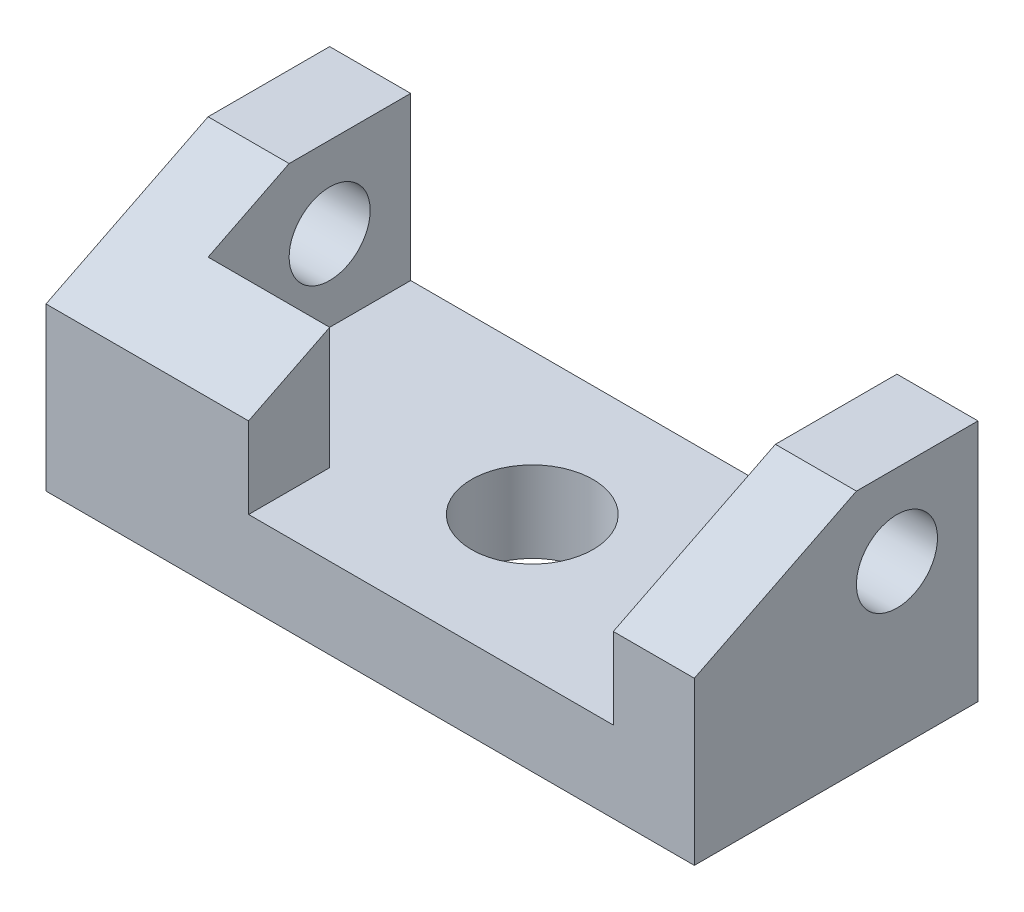
ISO-10303-21;
HEADER;
FILE_DESCRIPTION(('STEP AP214'),'2;1');
FILE_NAME('part.step','',(''),(''),'','','');
FILE_SCHEMA(('AUTOMOTIVE_DESIGN { 1 0 10303 214 1 1 1 1 }'));
ENDSEC;
DATA;
#1=APPLICATION_CONTEXT('core data for automotive mechanical design processes');
#2=APPLICATION_PROTOCOL_DEFINITION('international standard','automotive_design',2000,#1);
#3=PRODUCT_CONTEXT('',#1,'mechanical');
#4=PRODUCT('Part','Part','',(#3));
#5=PRODUCT_RELATED_PRODUCT_CATEGORY('part','',(#4));
#6=PRODUCT_DEFINITION_FORMATION('','',#4);
#7=PRODUCT_DEFINITION_CONTEXT('part definition',#1,'design');
#8=PRODUCT_DEFINITION('design','',#6,#7);
#9=PRODUCT_DEFINITION_SHAPE('','',#8);
#10=(LENGTH_UNIT() NAMED_UNIT(*) SI_UNIT(.MILLI.,.METRE.));
#11=(NAMED_UNIT(*) PLANE_ANGLE_UNIT() SI_UNIT($,.RADIAN.));
#12=(NAMED_UNIT(*) SI_UNIT($,.STERADIAN.) SOLID_ANGLE_UNIT());
#13=UNCERTAINTY_MEASURE_WITH_UNIT(LENGTH_MEASURE(1.E-05),#10,'distance_accuracy_value','');
#14=(GEOMETRIC_REPRESENTATION_CONTEXT(3) GLOBAL_UNCERTAINTY_ASSIGNED_CONTEXT((#13)) GLOBAL_UNIT_ASSIGNED_CONTEXT((#10,
#11,#12)) REPRESENTATION_CONTEXT('',''));
#15=CARTESIAN_POINT('',(0.,0.,0.));
#16=DIRECTION('',(0.,0.,1.));
#17=DIRECTION('',(1.,0.,0.));
#18=AXIS2_PLACEMENT_3D('',#15,#16,#17);
#19=CARTESIAN_POINT('',(0.,30.,0.));
#20=DIRECTION('',(0.,-1.,0.));
#21=DIRECTION('',(0.,0.,-1.));
#22=AXIS2_PLACEMENT_3D('',#19,#20,#21);
#23=PLANE('',#22);
#24=DIRECTION('',(0.,0.,-1.));
#25=VECTOR('',#24,1.);
#26=CARTESIAN_POINT('',(70.,30.,0.));
#27=LINE('',#26,#25);
#28=CARTESIAN_POINT('',(70.,30.,-20.));
#29=VERTEX_POINT('',#28);
#30=CARTESIAN_POINT('',(70.,30.,-35.));
#31=VERTEX_POINT('',#30);
#32=EDGE_CURVE('E143',#29,#31,#27,.T.);
#33=ORIENTED_EDGE('',*,*,#32,.F.);
#34=DIRECTION('',(-1.,0.,0.));
#35=VECTOR('',#34,1.);
#36=CARTESIAN_POINT('',(80.,30.,-20.));
#37=LINE('',#36,#35);
#38=CARTESIAN_POINT('',(80.,30.,-20.));
#39=VERTEX_POINT('',#38);
#40=EDGE_CURVE('E56',#39,#29,#37,.T.);
#41=ORIENTED_EDGE('',*,*,#40,.F.);
#42=DIRECTION('',(0.,0.,-1.));
#43=VECTOR('',#42,1.);
#44=CARTESIAN_POINT('',(80.,30.,0.));
#45=LINE('',#44,#43);
#46=CARTESIAN_POINT('',(80.,30.,-35.));
#47=VERTEX_POINT('',#46);
#48=EDGE_CURVE('E141',#39,#47,#45,.T.);
#49=ORIENTED_EDGE('',*,*,#48,.T.);
#50=DIRECTION('',(-1.,0.,0.));
#51=VECTOR('',#50,1.);
#52=CARTESIAN_POINT('',(0.,30.,-35.));
#53=LINE('',#52,#51);
#54=EDGE_CURVE('E157',#47,#31,#53,.T.);
#55=ORIENTED_EDGE('',*,*,#54,.T.);
#56=EDGE_LOOP('',(#33,#41,#49,#55));
#57=FACE_BOUND('',#56,.T.);
#58=ADVANCED_FACE('F39',(#57),#23,.F.);
#59=CARTESIAN_POINT('',(0.,30.,0.));
#60=DIRECTION('',(1.,0.,0.));
#61=DIRECTION('',(0.,0.,-1.));
#62=AXIS2_PLACEMENT_3D('',#59,#60,#61);
#63=PLANE('',#62);
#64=CARTESIAN_POINT('',(0.,20.,-25.));
#65=DIRECTION('',(1.,0.,0.));
#66=DIRECTION('',(0.,0.,-1.));
#67=AXIS2_PLACEMENT_3D('',#64,#65,#66);
#68=CIRCLE('',#67,5.);
#69=CARTESIAN_POINT('',(0.,20.,-30.));
#70=VERTEX_POINT('',#69);
#71=EDGE_CURVE('E324',#70,#70,#68,.T.);
#72=ORIENTED_EDGE('',*,*,#71,.T.);
#73=EDGE_LOOP('',(#72));
#74=FACE_BOUND('',#73,.T.);
#75=DIRECTION('',(0.,-1.,0.));
#76=VECTOR('',#75,1.);
#77=CARTESIAN_POINT('',(0.,30.,0.));
#78=LINE('',#77,#76);
#79=CARTESIAN_POINT('',(0.,20.,0.));
#80=VERTEX_POINT('',#79);
#81=CARTESIAN_POINT('',(0.,0.,0.));
#82=VERTEX_POINT('',#81);
#83=EDGE_CURVE('E49',#80,#82,#78,.T.);
#84=ORIENTED_EDGE('',*,*,#83,.F.);
#85=DIRECTION('',(0.,-0.447213595499958,0.894427190999916));
#86=VECTOR('',#85,1.);
#87=CARTESIAN_POINT('',(0.,20.,0.));
#88=LINE('',#87,#86);
#89=CARTESIAN_POINT('',(0.,30.,-20.));
#90=VERTEX_POINT('',#89);
#91=EDGE_CURVE('E136',#90,#80,#88,.T.);
#92=ORIENTED_EDGE('',*,*,#91,.F.);
#93=DIRECTION('',(0.,0.,1.));
#94=VECTOR('',#93,1.);
#95=CARTESIAN_POINT('',(0.,30.,0.));
#96=LINE('',#95,#94);
#97=CARTESIAN_POINT('',(0.,30.,-35.));
#98=VERTEX_POINT('',#97);
#99=EDGE_CURVE('E153',#98,#90,#96,.T.);
#100=ORIENTED_EDGE('',*,*,#99,.F.);
#101=DIRECTION('',(0.,-1.,0.));
#102=VECTOR('',#101,1.);
#103=CARTESIAN_POINT('',(0.,30.,-35.));
#104=LINE('',#103,#102);
#105=CARTESIAN_POINT('',(0.,0.,-35.));
#106=VERTEX_POINT('',#105);
#107=EDGE_CURVE('E165',#98,#106,#104,.T.);
#108=ORIENTED_EDGE('',*,*,#107,.T.);
#109=DIRECTION('',(0.,0.,1.));
#110=VECTOR('',#109,1.);
#111=CARTESIAN_POINT('',(0.,0.,0.));
#112=LINE('',#111,#110);
#113=EDGE_CURVE('E166',#106,#82,#112,.T.);
#114=ORIENTED_EDGE('',*,*,#113,.T.);
#115=EDGE_LOOP('',(#84,#92,#100,#108,#114));
#116=FACE_BOUND('',#115,.T.);
#117=ADVANCED_FACE('F41',(#74,#116),#63,.F.);
#118=CARTESIAN_POINT('',(0.,30.,0.));
#119=DIRECTION('',(0.,0.,-1.));
#120=DIRECTION('',(-1.,0.,0.));
#121=AXIS2_PLACEMENT_3D('',#118,#119,#120);
#122=PLANE('',#121);
#123=DIRECTION('',(0.,-1.,0.));
#124=VECTOR('',#123,1.);
#125=CARTESIAN_POINT('',(80.,30.,0.));
#126=LINE('',#125,#124);
#127=CARTESIAN_POINT('',(80.,20.,0.));
#128=VERTEX_POINT('',#127);
#129=CARTESIAN_POINT('',(80.,0.,0.));
#130=VERTEX_POINT('',#129);
#131=EDGE_CURVE('E185',#128,#130,#126,.T.);
#132=ORIENTED_EDGE('',*,*,#131,.F.);
#133=DIRECTION('',(-1.,0.,0.));
#134=VECTOR('',#133,1.);
#135=CARTESIAN_POINT('',(80.,20.,0.));
#136=LINE('',#135,#134);
#137=CARTESIAN_POINT('',(70.,20.,0.));
#138=VERTEX_POINT('',#137);
#139=EDGE_CURVE('E130',#128,#138,#136,.T.);
#140=ORIENTED_EDGE('',*,*,#139,.T.);
#141=DIRECTION('',(0.,1.,0.));
#142=VECTOR('',#141,1.);
#143=CARTESIAN_POINT('',(70.,10.,0.));
#144=LINE('',#143,#142);
#145=CARTESIAN_POINT('',(70.,10.,0.));
#146=VERTEX_POINT('',#145);
#147=EDGE_CURVE('E216',#146,#138,#144,.T.);
#148=ORIENTED_EDGE('',*,*,#147,.F.);
#149=DIRECTION('',(1.,0.,0.));
#150=VECTOR('',#149,1.);
#151=CARTESIAN_POINT('',(25.,10.,0.));
#152=LINE('',#151,#150);
#153=CARTESIAN_POINT('',(25.,10.,0.));
#154=VERTEX_POINT('',#153);
#155=EDGE_CURVE('E241',#154,#146,#152,.T.);
#156=ORIENTED_EDGE('',*,*,#155,.F.);
#157=DIRECTION('',(0.,1.,0.));
#158=VECTOR('',#157,1.);
#159=CARTESIAN_POINT('',(25.,10.,0.));
#160=LINE('',#159,#158);
#161=CARTESIAN_POINT('',(25.,20.,0.));
#162=VERTEX_POINT('',#161);
#163=EDGE_CURVE('E220',#154,#162,#160,.T.);
#164=ORIENTED_EDGE('',*,*,#163,.T.);
#165=EDGE_CURVE('E145',#162,#80,#136,.T.);
#166=ORIENTED_EDGE('',*,*,#165,.T.);
#167=ORIENTED_EDGE('',*,*,#83,.T.);
#168=DIRECTION('',(1.,0.,0.));
#169=VECTOR('',#168,1.);
#170=CARTESIAN_POINT('',(0.,0.,0.));
#171=LINE('',#170,#169);
#172=EDGE_CURVE('E170',#82,#130,#171,.T.);
#173=ORIENTED_EDGE('',*,*,#172,.T.);
#174=EDGE_LOOP('',(#132,#140,#148,#156,#164,#166,#167,#173));
#175=FACE_BOUND('',#174,.T.);
#176=ADVANCED_FACE('F193',(#175),#122,.F.);
#177=CARTESIAN_POINT('',(80.,30.,0.));
#178=DIRECTION('',(-1.,0.,0.));
#179=DIRECTION('',(0.,0.,1.));
#180=AXIS2_PLACEMENT_3D('',#177,#178,#179);
#181=PLANE('',#180);
#182=CARTESIAN_POINT('',(80.,20.,-25.));
#183=DIRECTION('',(1.,0.,0.));
#184=DIRECTION('',(0.,0.,-1.));
#185=AXIS2_PLACEMENT_3D('',#182,#183,#184);
#186=CIRCLE('',#185,5.);
#187=CARTESIAN_POINT('',(80.,20.,-30.));
#188=VERTEX_POINT('',#187);
#189=EDGE_CURVE('E320',#188,#188,#186,.T.);
#190=ORIENTED_EDGE('',*,*,#189,.F.);
#191=EDGE_LOOP('',(#190));
#192=FACE_BOUND('',#191,.T.);
#193=ORIENTED_EDGE('',*,*,#48,.F.);
#194=DIRECTION('',(0.,-0.447213595499958,0.894427190999916));
#195=VECTOR('',#194,1.);
#196=CARTESIAN_POINT('',(80.,20.,0.));
#197=LINE('',#196,#195);
#198=EDGE_CURVE('E127',#39,#128,#197,.T.);
#199=ORIENTED_EDGE('',*,*,#198,.T.);
#200=ORIENTED_EDGE('',*,*,#131,.T.);
#201=DIRECTION('',(0.,0.,-1.));
#202=VECTOR('',#201,1.);
#203=CARTESIAN_POINT('',(80.,0.,0.));
#204=LINE('',#203,#202);
#205=CARTESIAN_POINT('',(80.,0.,-35.));
#206=VERTEX_POINT('',#205);
#207=EDGE_CURVE('E175',#130,#206,#204,.T.);
#208=ORIENTED_EDGE('',*,*,#207,.T.);
#209=DIRECTION('',(0.,-1.,0.));
#210=VECTOR('',#209,1.);
#211=CARTESIAN_POINT('',(80.,30.,-35.));
#212=LINE('',#211,#210);
#213=EDGE_CURVE('E149',#47,#206,#212,.T.);
#214=ORIENTED_EDGE('',*,*,#213,.F.);
#215=EDGE_LOOP('',(#193,#199,#200,#208,#214));
#216=FACE_BOUND('',#215,.T.);
#217=ADVANCED_FACE('F147',(#192,#216),#181,.F.);
#218=CARTESIAN_POINT('',(0.,30.,-35.));
#219=DIRECTION('',(0.,0.,1.));
#220=DIRECTION('',(1.,0.,0.));
#221=AXIS2_PLACEMENT_3D('',#218,#219,#220);
#222=PLANE('',#221);
#223=DIRECTION('',(-1.,0.,0.));
#224=VECTOR('',#223,1.);
#225=CARTESIAN_POINT('',(70.,10.,-35.));
#226=LINE('',#225,#224);
#227=CARTESIAN_POINT('',(70.,10.,-35.));
#228=VERTEX_POINT('',#227);
#229=CARTESIAN_POINT('',(10.,10.,-35.));
#230=VERTEX_POINT('',#229);
#231=EDGE_CURVE('E211',#228,#230,#226,.T.);
#232=ORIENTED_EDGE('',*,*,#231,.F.);
#233=DIRECTION('',(0.,1.,0.));
#234=VECTOR('',#233,1.);
#235=CARTESIAN_POINT('',(70.,10.,-35.));
#236=LINE('',#235,#234);
#237=EDGE_CURVE('E171',#228,#31,#236,.T.);
#238=ORIENTED_EDGE('',*,*,#237,.T.);
#239=ORIENTED_EDGE('',*,*,#54,.F.);
#240=ORIENTED_EDGE('',*,*,#213,.T.);
#241=DIRECTION('',(-1.,0.,0.));
#242=VECTOR('',#241,1.);
#243=CARTESIAN_POINT('',(0.,0.,-35.));
#244=LINE('',#243,#242);
#245=EDGE_CURVE('E160',#206,#106,#244,.T.);
#246=ORIENTED_EDGE('',*,*,#245,.T.);
#247=ORIENTED_EDGE('',*,*,#107,.F.);
#248=CARTESIAN_POINT('',(10.,30.,-35.));
#249=VERTEX_POINT('',#248);
#250=EDGE_CURVE('E152',#249,#98,#53,.T.);
#251=ORIENTED_EDGE('',*,*,#250,.F.);
#252=DIRECTION('',(0.,1.,0.));
#253=VECTOR('',#252,1.);
#254=CARTESIAN_POINT('',(10.,10.,-35.));
#255=LINE('',#254,#253);
#256=EDGE_CURVE('E234',#230,#249,#255,.T.);
#257=ORIENTED_EDGE('',*,*,#256,.F.);
#258=EDGE_LOOP('',(#232,#238,#239,#240,#246,#247,#251,#257));
#259=FACE_BOUND('',#258,.T.);
#260=ADVANCED_FACE('F207',(#259),#222,.F.);
#261=ORIENTED_EDGE('',*,*,#99,.T.);
#262=CARTESIAN_POINT('',(9.99999999999999,30.,-20.));
#263=VERTEX_POINT('',#262);
#264=EDGE_CURVE('E135',#263,#90,#37,.T.);
#265=ORIENTED_EDGE('',*,*,#264,.F.);
#266=DIRECTION('',(0.,0.,1.));
#267=VECTOR('',#266,1.);
#268=CARTESIAN_POINT('',(10.,30.,-35.));
#269=LINE('',#268,#267);
#270=EDGE_CURVE('E248',#249,#263,#269,.T.);
#271=ORIENTED_EDGE('',*,*,#270,.F.);
#272=ORIENTED_EDGE('',*,*,#250,.T.);
#273=EDGE_LOOP('',(#261,#265,#271,#272));
#274=FACE_BOUND('',#273,.T.);
#275=ADVANCED_FACE('F288',(#274),#23,.F.);
#276=CARTESIAN_POINT('',(0.,0.,0.));
#277=DIRECTION('',(0.,-1.,0.));
#278=DIRECTION('',(0.,0.,-1.));
#279=AXIS2_PLACEMENT_3D('',#276,#277,#278);
#280=PLANE('',#279);
#281=CARTESIAN_POINT('',(42.5,0.,-17.5));
#282=DIRECTION('',(0.,1.,0.));
#283=DIRECTION('',(0.,0.,1.));
#284=AXIS2_PLACEMENT_3D('',#281,#282,#283);
#285=CIRCLE('',#284,7.5);
#286=CARTESIAN_POINT('',(42.5,0.,-10.));
#287=VERTEX_POINT('',#286);
#288=EDGE_CURVE('E325',#287,#287,#285,.T.);
#289=ORIENTED_EDGE('',*,*,#288,.T.);
#290=EDGE_LOOP('',(#289));
#291=FACE_BOUND('',#290,.T.);
#292=ORIENTED_EDGE('',*,*,#113,.F.);
#293=ORIENTED_EDGE('',*,*,#245,.F.);
#294=ORIENTED_EDGE('',*,*,#207,.F.);
#295=ORIENTED_EDGE('',*,*,#172,.F.);
#296=EDGE_LOOP('',(#292,#293,#294,#295));
#297=FACE_BOUND('',#296,.T.);
#298=ADVANCED_FACE('F200',(#291,#297),#280,.T.);
#299=CARTESIAN_POINT('',(70.,10.,0.));
#300=DIRECTION('',(1.,0.,0.));
#301=DIRECTION('',(0.,0.,-1.));
#302=AXIS2_PLACEMENT_3D('',#299,#300,#301);
#303=PLANE('',#302);
#304=CARTESIAN_POINT('',(70.,20.,-25.));
#305=DIRECTION('',(1.,0.,0.));
#306=DIRECTION('',(0.,0.,-1.));
#307=AXIS2_PLACEMENT_3D('',#304,#305,#306);
#308=CIRCLE('',#307,5.);
#309=CARTESIAN_POINT('',(70.,20.,-30.));
#310=VERTEX_POINT('',#309);
#311=EDGE_CURVE('E316',#310,#310,#308,.T.);
#312=ORIENTED_EDGE('',*,*,#311,.T.);
#313=EDGE_LOOP('',(#312));
#314=FACE_BOUND('',#313,.T.);
#315=ORIENTED_EDGE('',*,*,#147,.T.);
#316=DIRECTION('',(0.,0.447213595499958,-0.894427190999916));
#317=VECTOR('',#316,1.);
#318=CARTESIAN_POINT('',(70.,18.,4.));
#319=LINE('',#318,#317);
#320=EDGE_CURVE('E250',#138,#29,#319,.T.);
#321=ORIENTED_EDGE('',*,*,#320,.T.);
#322=ORIENTED_EDGE('',*,*,#32,.T.);
#323=ORIENTED_EDGE('',*,*,#237,.F.);
#324=DIRECTION('',(0.,0.,-1.));
#325=VECTOR('',#324,1.);
#326=CARTESIAN_POINT('',(70.,10.,0.));
#327=LINE('',#326,#325);
#328=EDGE_CURVE('E236',#146,#228,#327,.T.);
#329=ORIENTED_EDGE('',*,*,#328,.F.);
#330=EDGE_LOOP('',(#315,#321,#322,#323,#329));
#331=FACE_BOUND('',#330,.T.);
#332=ADVANCED_FACE('F277',(#314,#331),#303,.F.);
#333=CARTESIAN_POINT('',(25.,10.,-10.0023550010452));
#334=DIRECTION('',(-1.,0.,0.));
#335=DIRECTION('',(0.,0.,1.));
#336=AXIS2_PLACEMENT_3D('',#333,#334,#335);
#337=PLANE('',#336);
#338=DIRECTION('',(0.,1.,0.));
#339=VECTOR('',#338,1.);
#340=CARTESIAN_POINT('',(25.,10.,-10.0023550010452));
#341=LINE('',#340,#339);
#342=CARTESIAN_POINT('',(25.,10.,-10.0023550010452));
#343=VERTEX_POINT('',#342);
#344=CARTESIAN_POINT('',(25.,25.0011775005226,-10.0023550010452));
#345=VERTEX_POINT('',#344);
#346=EDGE_CURVE('E227',#343,#345,#341,.T.);
#347=ORIENTED_EDGE('',*,*,#346,.T.);
#348=DIRECTION('',(0.,-0.447213595499958,0.894427190999916));
#349=VECTOR('',#348,1.);
#350=CARTESIAN_POINT('',(25.,22.0009420004181,-4.00188400083613));
#351=LINE('',#350,#349);
#352=EDGE_CURVE('E253',#345,#162,#351,.T.);
#353=ORIENTED_EDGE('',*,*,#352,.T.);
#354=ORIENTED_EDGE('',*,*,#163,.F.);
#355=DIRECTION('',(0.,0.,1.));
#356=VECTOR('',#355,1.);
#357=CARTESIAN_POINT('',(25.,10.,-10.0023550010452));
#358=LINE('',#357,#356);
#359=EDGE_CURVE('E245',#343,#154,#358,.T.);
#360=ORIENTED_EDGE('',*,*,#359,.F.);
#361=EDGE_LOOP('',(#347,#353,#354,#360));
#362=FACE_BOUND('',#361,.T.);
#363=ADVANCED_FACE('F279',(#362),#337,.F.);
#364=CARTESIAN_POINT('',(10.,10.,-10.0023550010452));
#365=DIRECTION('',(0.,0.,1.));
#366=DIRECTION('',(1.,0.,0.));
#367=AXIS2_PLACEMENT_3D('',#364,#365,#366);
#368=PLANE('',#367);
#369=DIRECTION('',(0.,1.,0.));
#370=VECTOR('',#369,1.);
#371=CARTESIAN_POINT('',(10.,10.,-10.0023550010452));
#372=LINE('',#371,#370);
#373=CARTESIAN_POINT('',(10.,10.,-10.0023550010452));
#374=VERTEX_POINT('',#373);
#375=CARTESIAN_POINT('',(10.,25.0011775005226,-10.0023550010452));
#376=VERTEX_POINT('',#375);
#377=EDGE_CURVE('E231',#374,#376,#372,.T.);
#378=ORIENTED_EDGE('',*,*,#377,.T.);
#379=DIRECTION('',(1.,0.,0.));
#380=VECTOR('',#379,1.);
#381=CARTESIAN_POINT('',(10.,25.0011775005226,-10.0023550010452));
#382=LINE('',#381,#380);
#383=EDGE_CURVE('E64',#376,#345,#382,.T.);
#384=ORIENTED_EDGE('',*,*,#383,.T.);
#385=ORIENTED_EDGE('',*,*,#346,.F.);
#386=DIRECTION('',(1.,0.,0.));
#387=VECTOR('',#386,1.);
#388=CARTESIAN_POINT('',(10.,10.,-10.0023550010452));
#389=LINE('',#388,#387);
#390=EDGE_CURVE('E266',#374,#343,#389,.T.);
#391=ORIENTED_EDGE('',*,*,#390,.F.);
#392=EDGE_LOOP('',(#378,#384,#385,#391));
#393=FACE_BOUND('',#392,.T.);
#394=ADVANCED_FACE('F286',(#393),#368,.F.);
#395=CARTESIAN_POINT('',(10.,10.,-35.));
#396=DIRECTION('',(-1.,0.,0.));
#397=DIRECTION('',(0.,0.,1.));
#398=AXIS2_PLACEMENT_3D('',#395,#396,#397);
#399=PLANE('',#398);
#400=CARTESIAN_POINT('',(10.,20.,-25.));
#401=DIRECTION('',(-1.,0.,0.));
#402=DIRECTION('',(0.,0.,1.));
#403=AXIS2_PLACEMENT_3D('',#400,#401,#402);
#404=CIRCLE('',#403,5.);
#405=CARTESIAN_POINT('',(10.,20.,-20.));
#406=VERTEX_POINT('',#405);
#407=EDGE_CURVE('E43',#406,#406,#404,.T.);
#408=ORIENTED_EDGE('',*,*,#407,.T.);
#409=EDGE_LOOP('',(#408));
#410=FACE_BOUND('',#409,.T.);
#411=ORIENTED_EDGE('',*,*,#270,.T.);
#412=DIRECTION('',(0.,-0.447213595499958,0.894427190999916));
#413=VECTOR('',#412,1.);
#414=CARTESIAN_POINT('',(10.,32.,-24.));
#415=LINE('',#414,#413);
#416=EDGE_CURVE('E11',#263,#376,#415,.T.);
#417=ORIENTED_EDGE('',*,*,#416,.T.);
#418=ORIENTED_EDGE('',*,*,#377,.F.);
#419=DIRECTION('',(0.,0.,1.));
#420=VECTOR('',#419,1.);
#421=CARTESIAN_POINT('',(10.,10.,-35.));
#422=LINE('',#421,#420);
#423=EDGE_CURVE('E262',#230,#374,#422,.T.);
#424=ORIENTED_EDGE('',*,*,#423,.F.);
#425=ORIENTED_EDGE('',*,*,#256,.T.);
#426=EDGE_LOOP('',(#411,#417,#418,#424,#425));
#427=FACE_BOUND('',#426,.T.);
#428=ADVANCED_FACE('F345',(#410,#427),#399,.F.);
#429=CARTESIAN_POINT('',(0.,10.,0.));
#430=DIRECTION('',(0.,1.,0.));
#431=DIRECTION('',(0.,0.,1.));
#432=AXIS2_PLACEMENT_3D('',#429,#430,#431);
#433=PLANE('',#432);
#434=CARTESIAN_POINT('',(42.5,10.,-17.5));
#435=DIRECTION('',(0.,1.,0.));
#436=DIRECTION('',(0.,0.,1.));
#437=AXIS2_PLACEMENT_3D('',#434,#435,#436);
#438=CIRCLE('',#437,7.5);
#439=CARTESIAN_POINT('',(42.5,10.,-10.));
#440=VERTEX_POINT('',#439);
#441=EDGE_CURVE('E329',#440,#440,#438,.T.);
#442=ORIENTED_EDGE('',*,*,#441,.F.);
#443=EDGE_LOOP('',(#442));
#444=FACE_BOUND('',#443,.T.);
#445=ORIENTED_EDGE('',*,*,#231,.T.);
#446=ORIENTED_EDGE('',*,*,#423,.T.);
#447=ORIENTED_EDGE('',*,*,#390,.T.);
#448=ORIENTED_EDGE('',*,*,#359,.T.);
#449=ORIENTED_EDGE('',*,*,#155,.T.);
#450=ORIENTED_EDGE('',*,*,#328,.T.);
#451=EDGE_LOOP('',(#445,#446,#447,#448,#449,#450));
#452=FACE_BOUND('',#451,.T.);
#453=ADVANCED_FACE('F273',(#444,#452),#433,.T.);
#454=CARTESIAN_POINT('',(80.,20.,0.));
#455=DIRECTION('',(0.,-0.894427190999916,-0.447213595499958));
#456=DIRECTION('',(0.,0.447213595499958,-0.894427190999916));
#457=AXIS2_PLACEMENT_3D('',#454,#455,#456);
#458=PLANE('',#457);
#459=ORIENTED_EDGE('',*,*,#383,.F.);
#460=ORIENTED_EDGE('',*,*,#416,.F.);
#461=ORIENTED_EDGE('',*,*,#264,.T.);
#462=ORIENTED_EDGE('',*,*,#91,.T.);
#463=ORIENTED_EDGE('',*,*,#165,.F.);
#464=ORIENTED_EDGE('',*,*,#352,.F.);
#465=EDGE_LOOP('',(#459,#460,#461,#462,#463,#464));
#466=FACE_BOUND('',#465,.T.);
#467=ADVANCED_FACE('F314',(#466),#458,.F.);
#468=ORIENTED_EDGE('',*,*,#139,.F.);
#469=ORIENTED_EDGE('',*,*,#198,.F.);
#470=ORIENTED_EDGE('',*,*,#40,.T.);
#471=ORIENTED_EDGE('',*,*,#320,.F.);
#472=EDGE_LOOP('',(#468,#469,#470,#471));
#473=FACE_BOUND('',#472,.T.);
#474=ADVANCED_FACE('F128',(#473),#458,.F.);
#475=CARTESIAN_POINT('',(0.,20.,-25.));
#476=DIRECTION('',(1.,0.,0.));
#477=DIRECTION('',(0.,0.,-1.));
#478=AXIS2_PLACEMENT_3D('',#475,#476,#477);
#479=CYLINDRICAL_SURFACE('',#478,5.);
#480=ORIENTED_EDGE('',*,*,#71,.F.);
#481=EDGE_LOOP('',(#480));
#482=FACE_BOUND('',#481,.T.);
#483=ORIENTED_EDGE('',*,*,#407,.F.);
#484=EDGE_LOOP('',(#483));
#485=FACE_BOUND('',#484,.T.);
#486=ADVANCED_FACE('F354',(#482,#485),#479,.F.);
#487=ORIENTED_EDGE('',*,*,#189,.T.);
#488=EDGE_LOOP('',(#487));
#489=FACE_BOUND('',#488,.T.);
#490=ORIENTED_EDGE('',*,*,#311,.F.);
#491=EDGE_LOOP('',(#490));
#492=FACE_BOUND('',#491,.T.);
#493=ADVANCED_FACE('F340',(#489,#492),#479,.F.);
#494=CARTESIAN_POINT('',(42.5,0.,-17.5));
#495=DIRECTION('',(0.,1.,0.));
#496=DIRECTION('',(0.,0.,1.));
#497=AXIS2_PLACEMENT_3D('',#494,#495,#496);
#498=CYLINDRICAL_SURFACE('',#497,7.5);
#499=ORIENTED_EDGE('',*,*,#288,.F.);
#500=EDGE_LOOP('',(#499));
#501=FACE_BOUND('',#500,.T.);
#502=ORIENTED_EDGE('',*,*,#441,.T.);
#503=EDGE_LOOP('',(#502));
#504=FACE_BOUND('',#503,.T.);
#505=ADVANCED_FACE('F337',(#501,#504),#498,.F.);
#506=CLOSED_SHELL('',(#58,#117,#176,#217,#260,#275,#298,#332,#363,#394,#428,#453,#467,#474,#486,
#493,#505));
#507=MANIFOLD_SOLID_BREP('B2',#506);
#508=ADVANCED_BREP_SHAPE_REPRESENTATION('',(#18,#507),#14);
#509=SHAPE_DEFINITION_REPRESENTATION(#9,#508);
ENDSEC;
END-ISO-10303-21;
